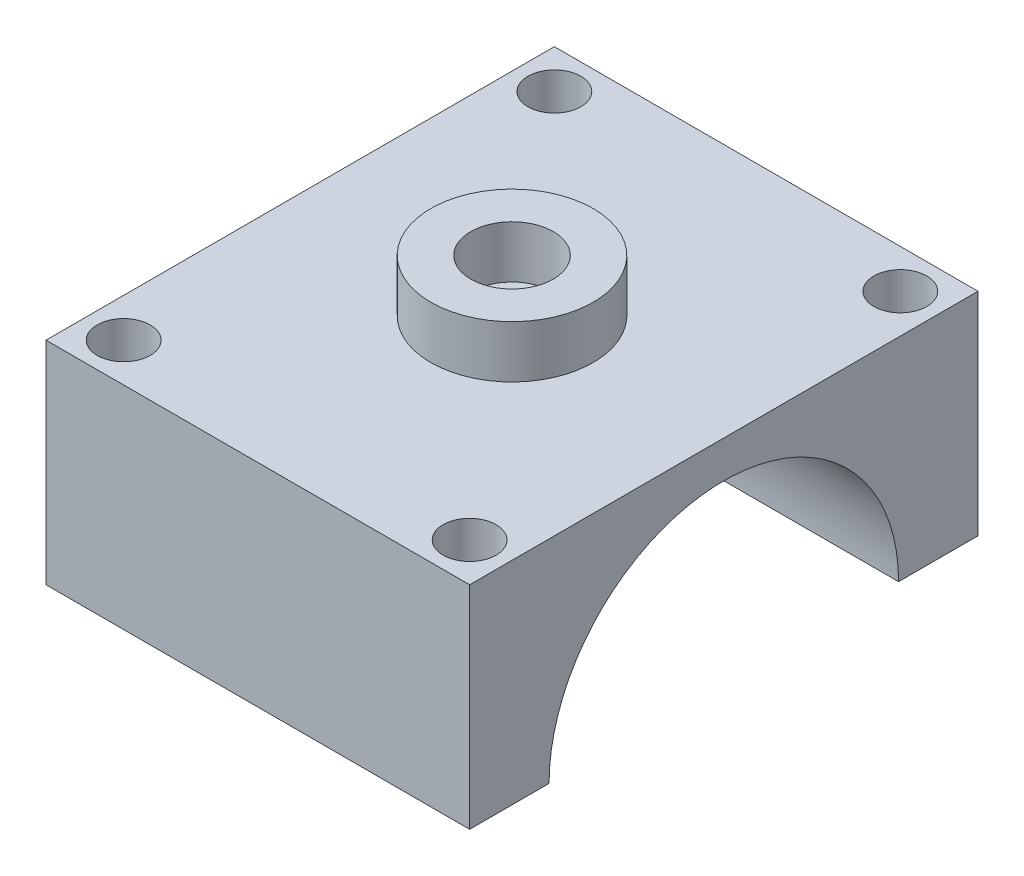
ISO-10303-21;
HEADER;
FILE_DESCRIPTION(('STEP AP214'),'2;1');
FILE_NAME('part.step','',(''),(''),'','','');
FILE_SCHEMA(('AUTOMOTIVE_DESIGN { 1 0 10303 214 1 1 1 1 }'));
ENDSEC;
DATA;
#1=APPLICATION_CONTEXT('core data for automotive mechanical design processes');
#2=APPLICATION_PROTOCOL_DEFINITION('international standard','automotive_design',2000,#1);
#3=PRODUCT_CONTEXT('',#1,'mechanical');
#4=PRODUCT('Part','Part','',(#3));
#5=PRODUCT_RELATED_PRODUCT_CATEGORY('part','',(#4));
#6=PRODUCT_DEFINITION_FORMATION('','',#4);
#7=PRODUCT_DEFINITION_CONTEXT('part definition',#1,'design');
#8=PRODUCT_DEFINITION('design','',#6,#7);
#9=PRODUCT_DEFINITION_SHAPE('','',#8);
#10=(LENGTH_UNIT() NAMED_UNIT(*) SI_UNIT(.MILLI.,.METRE.));
#11=(NAMED_UNIT(*) PLANE_ANGLE_UNIT() SI_UNIT($,.RADIAN.));
#12=(NAMED_UNIT(*) SI_UNIT($,.STERADIAN.) SOLID_ANGLE_UNIT());
#13=UNCERTAINTY_MEASURE_WITH_UNIT(LENGTH_MEASURE(1.E-05),#10,'distance_accuracy_value','');
#14=(GEOMETRIC_REPRESENTATION_CONTEXT(3) GLOBAL_UNCERTAINTY_ASSIGNED_CONTEXT((#13)) GLOBAL_UNIT_ASSIGNED_CONTEXT((#10,
#11,#12)) REPRESENTATION_CONTEXT('',''));
#15=CARTESIAN_POINT('',(0.,0.,0.));
#16=DIRECTION('',(0.,0.,1.));
#17=DIRECTION('',(1.,0.,0.));
#18=AXIS2_PLACEMENT_3D('',#15,#16,#17);
#19=CARTESIAN_POINT('',(0.,26.3,0.));
#20=DIRECTION('',(0.,1.,0.));
#21=DIRECTION('',(0.,0.,1.));
#22=AXIS2_PLACEMENT_3D('',#19,#20,#21);
#23=CYLINDRICAL_SURFACE('',#22,1.75);
#24=CARTESIAN_POINT('',(0.,30.,0.));
#25=DIRECTION('',(0.,1.,0.));
#26=DIRECTION('',(0.,0.,1.));
#27=AXIS2_PLACEMENT_3D('',#24,#25,#26);
#28=CIRCLE('',#27,1.75);
#29=CARTESIAN_POINT('',(0.,30.,1.75));
#30=VERTEX_POINT('',#29);
#31=EDGE_CURVE('E165',#30,#30,#28,.T.);
#32=ORIENTED_EDGE('',*,*,#31,.T.);
#33=EDGE_LOOP('',(#32));
#34=FACE_BOUND('',#33,.T.);
#35=CARTESIAN_POINT('',(0.,28.5,0.));
#36=DIRECTION('',(0.,-1.,0.));
#37=DIRECTION('',(0.,0.,-1.));
#38=AXIS2_PLACEMENT_3D('',#35,#36,#37);
#39=CIRCLE('',#38,1.75);
#40=CARTESIAN_POINT('',(0.,28.5,-1.75));
#41=VERTEX_POINT('',#40);
#42=EDGE_CURVE('E156',#41,#41,#39,.F.);
#43=ORIENTED_EDGE('',*,*,#42,.F.);
#44=EDGE_LOOP('',(#43));
#45=FACE_BOUND('',#44,.T.);
#46=ADVANCED_FACE('F49',(#34,#45),#23,.F.);
#47=CARTESIAN_POINT('',(15.,30.,18.));
#48=DIRECTION('',(-1.,0.,0.));
#49=DIRECTION('',(0.,0.,1.));
#50=AXIS2_PLACEMENT_3D('',#47,#48,#49);
#51=PLANE('',#50);
#52=DIRECTION('',(0.,-1.,0.));
#53=VECTOR('',#52,1.);
#54=CARTESIAN_POINT('',(15.,30.,18.));
#55=LINE('',#54,#53);
#56=CARTESIAN_POINT('',(15.,30.,18.));
#57=VERTEX_POINT('',#56);
#58=CARTESIAN_POINT('',(15.,15.,18.));
#59=VERTEX_POINT('',#58);
#60=EDGE_CURVE('E137',#57,#59,#55,.T.);
#61=ORIENTED_EDGE('',*,*,#60,.T.);
#62=DIRECTION('',(0.,0.,1.));
#63=VECTOR('',#62,1.);
#64=CARTESIAN_POINT('',(15.,15.,18.));
#65=LINE('',#64,#63);
#66=CARTESIAN_POINT('',(15.,15.,12.375));
#67=VERTEX_POINT('',#66);
#68=EDGE_CURVE('E111',#67,#59,#65,.T.);
#69=ORIENTED_EDGE('',*,*,#68,.F.);
#70=CARTESIAN_POINT('',(15.,15.,0.));
#71=DIRECTION('',(1.,0.,0.));
#72=DIRECTION('',(0.,0.,-1.));
#73=AXIS2_PLACEMENT_3D('',#70,#71,#72);
#74=CIRCLE('',#73,12.375);
#75=CARTESIAN_POINT('',(15.,15.,-12.375));
#76=VERTEX_POINT('',#75);
#77=EDGE_CURVE('E151',#76,#67,#74,.T.);
#78=ORIENTED_EDGE('',*,*,#77,.F.);
#79=CARTESIAN_POINT('',(15.,15.,-18.));
#80=VERTEX_POINT('',#79);
#81=EDGE_CURVE('E80',#80,#76,#65,.T.);
#82=ORIENTED_EDGE('',*,*,#81,.F.);
#83=DIRECTION('',(0.,-1.,0.));
#84=VECTOR('',#83,1.);
#85=CARTESIAN_POINT('',(15.,30.,-18.));
#86=LINE('',#85,#84);
#87=CARTESIAN_POINT('',(15.,30.,-18.));
#88=VERTEX_POINT('',#87);
#89=EDGE_CURVE('E64',#88,#80,#86,.T.);
#90=ORIENTED_EDGE('',*,*,#89,.F.);
#91=DIRECTION('',(0.,0.,-1.));
#92=VECTOR('',#91,1.);
#93=CARTESIAN_POINT('',(15.,30.,18.));
#94=LINE('',#93,#92);
#95=EDGE_CURVE('E150',#57,#88,#94,.T.);
#96=ORIENTED_EDGE('',*,*,#95,.F.);
#97=EDGE_LOOP('',(#61,#69,#78,#82,#90,#96));
#98=FACE_BOUND('',#97,.T.);
#99=ADVANCED_FACE('F51',(#98),#51,.F.);
#100=CARTESIAN_POINT('',(-15.,30.,-18.));
#101=DIRECTION('',(0.,0.,1.));
#102=DIRECTION('',(1.,0.,0.));
#103=AXIS2_PLACEMENT_3D('',#100,#101,#102);
#104=PLANE('',#103);
#105=ORIENTED_EDGE('',*,*,#89,.T.);
#106=DIRECTION('',(1.,0.,0.));
#107=VECTOR('',#106,1.);
#108=CARTESIAN_POINT('',(-15.,15.,-18.));
#109=LINE('',#108,#107);
#110=CARTESIAN_POINT('',(-15.,15.,-18.));
#111=VERTEX_POINT('',#110);
#112=EDGE_CURVE('E117',#111,#80,#109,.T.);
#113=ORIENTED_EDGE('',*,*,#112,.F.);
#114=DIRECTION('',(0.,-1.,0.));
#115=VECTOR('',#114,1.);
#116=CARTESIAN_POINT('',(-15.,30.,-18.));
#117=LINE('',#116,#115);
#118=CARTESIAN_POINT('',(-15.,30.,-18.));
#119=VERTEX_POINT('',#118);
#120=EDGE_CURVE('E136',#119,#111,#117,.T.);
#121=ORIENTED_EDGE('',*,*,#120,.F.);
#122=DIRECTION('',(-1.,0.,0.));
#123=VECTOR('',#122,1.);
#124=CARTESIAN_POINT('',(-15.,30.,-18.));
#125=LINE('',#124,#123);
#126=EDGE_CURVE('E230',#88,#119,#125,.T.);
#127=ORIENTED_EDGE('',*,*,#126,.F.);
#128=EDGE_LOOP('',(#105,#113,#121,#127));
#129=FACE_BOUND('',#128,.T.);
#130=ADVANCED_FACE('F244',(#129),#104,.F.);
#131=CARTESIAN_POINT('',(-15.,30.,18.));
#132=DIRECTION('',(1.,0.,0.));
#133=DIRECTION('',(0.,0.,-1.));
#134=AXIS2_PLACEMENT_3D('',#131,#132,#133);
#135=PLANE('',#134);
#136=ORIENTED_EDGE('',*,*,#120,.T.);
#137=DIRECTION('',(0.,0.,1.));
#138=VECTOR('',#137,1.);
#139=CARTESIAN_POINT('',(-15.,15.,18.));
#140=LINE('',#139,#138);
#141=CARTESIAN_POINT('',(-15.,15.,-12.375));
#142=VERTEX_POINT('',#141);
#143=EDGE_CURVE('E118',#111,#142,#140,.T.);
#144=ORIENTED_EDGE('',*,*,#143,.T.);
#145=CARTESIAN_POINT('',(-15.,15.,0.));
#146=DIRECTION('',(1.,0.,0.));
#147=DIRECTION('',(0.,0.,-1.));
#148=AXIS2_PLACEMENT_3D('',#145,#146,#147);
#149=CIRCLE('',#148,12.375);
#150=CARTESIAN_POINT('',(-15.,15.,12.375));
#151=VERTEX_POINT('',#150);
#152=EDGE_CURVE('E130',#142,#151,#149,.T.);
#153=ORIENTED_EDGE('',*,*,#152,.T.);
#154=CARTESIAN_POINT('',(-15.,15.,18.));
#155=VERTEX_POINT('',#154);
#156=EDGE_CURVE('E72',#151,#155,#140,.T.);
#157=ORIENTED_EDGE('',*,*,#156,.T.);
#158=DIRECTION('',(0.,-1.,0.));
#159=VECTOR('',#158,1.);
#160=CARTESIAN_POINT('',(-15.,30.,18.));
#161=LINE('',#160,#159);
#162=CARTESIAN_POINT('',(-15.,30.,18.));
#163=VERTEX_POINT('',#162);
#164=EDGE_CURVE('E126',#163,#155,#161,.T.);
#165=ORIENTED_EDGE('',*,*,#164,.F.);
#166=DIRECTION('',(0.,0.,1.));
#167=VECTOR('',#166,1.);
#168=CARTESIAN_POINT('',(-15.,30.,18.));
#169=LINE('',#168,#167);
#170=EDGE_CURVE('E233',#119,#163,#169,.T.);
#171=ORIENTED_EDGE('',*,*,#170,.F.);
#172=EDGE_LOOP('',(#136,#144,#153,#157,#165,#171));
#173=FACE_BOUND('',#172,.T.);
#174=ADVANCED_FACE('F124',(#173),#135,.F.);
#175=CARTESIAN_POINT('',(-15.,30.,18.));
#176=DIRECTION('',(0.,0.,-1.));
#177=DIRECTION('',(-1.,0.,0.));
#178=AXIS2_PLACEMENT_3D('',#175,#176,#177);
#179=PLANE('',#178);
#180=ORIENTED_EDGE('',*,*,#164,.T.);
#181=DIRECTION('',(1.,0.,0.));
#182=VECTOR('',#181,1.);
#183=CARTESIAN_POINT('',(-15.,15.,18.));
#184=LINE('',#183,#182);
#185=EDGE_CURVE('E108',#155,#59,#184,.T.);
#186=ORIENTED_EDGE('',*,*,#185,.T.);
#187=ORIENTED_EDGE('',*,*,#60,.F.);
#188=DIRECTION('',(1.,0.,0.));
#189=VECTOR('',#188,1.);
#190=CARTESIAN_POINT('',(-15.,30.,18.));
#191=LINE('',#190,#189);
#192=EDGE_CURVE('E134',#163,#57,#191,.T.);
#193=ORIENTED_EDGE('',*,*,#192,.F.);
#194=EDGE_LOOP('',(#180,#186,#187,#193));
#195=FACE_BOUND('',#194,.T.);
#196=ADVANCED_FACE('F133',(#195),#179,.F.);
#197=CARTESIAN_POINT('',(0.,30.,0.));
#198=DIRECTION('',(0.,-1.,0.));
#199=DIRECTION('',(0.,0.,-1.));
#200=AXIS2_PLACEMENT_3D('',#197,#198,#199);
#201=PLANE('',#200);
#202=CARTESIAN_POINT('',(0.,30.,0.));
#203=DIRECTION('',(0.,-1.,0.));
#204=DIRECTION('',(0.,0.,-1.));
#205=AXIS2_PLACEMENT_3D('',#202,#203,#204);
#206=CIRCLE('',#205,5.75);
#207=CARTESIAN_POINT('',(0.,30.,-5.75));
#208=VERTEX_POINT('',#207);
#209=EDGE_CURVE('E11',#208,#208,#206,.F.);
#210=ORIENTED_EDGE('',*,*,#209,.F.);
#211=EDGE_LOOP('',(#210));
#212=FACE_BOUND('',#211,.T.);
#213=CARTESIAN_POINT('',(12.25,30.,-15.25));
#214=DIRECTION('',(0.,1.,0.));
#215=DIRECTION('',(0.,0.,-1.));
#216=AXIS2_PLACEMENT_3D('',#213,#214,#215);
#217=CIRCLE('',#216,1.875);
#218=CARTESIAN_POINT('',(12.25,30.,-17.125));
#219=VERTEX_POINT('',#218);
#220=EDGE_CURVE('E208',#219,#219,#217,.T.);
#221=ORIENTED_EDGE('',*,*,#220,.F.);
#222=EDGE_LOOP('',(#221));
#223=FACE_BOUND('',#222,.T.);
#224=CARTESIAN_POINT('',(12.25,30.,15.25));
#225=DIRECTION('',(0.,1.,0.));
#226=DIRECTION('',(0.,0.,1.));
#227=AXIS2_PLACEMENT_3D('',#224,#225,#226);
#228=CIRCLE('',#227,1.875);
#229=CARTESIAN_POINT('',(12.25,30.,17.125));
#230=VERTEX_POINT('',#229);
#231=EDGE_CURVE('E214',#230,#230,#228,.T.);
#232=ORIENTED_EDGE('',*,*,#231,.F.);
#233=EDGE_LOOP('',(#232));
#234=FACE_BOUND('',#233,.T.);
#235=CARTESIAN_POINT('',(-12.25,30.,15.25));
#236=DIRECTION('',(0.,1.,0.));
#237=DIRECTION('',(0.,0.,-1.));
#238=AXIS2_PLACEMENT_3D('',#235,#236,#237);
#239=CIRCLE('',#238,1.875);
#240=CARTESIAN_POINT('',(-12.25,30.,13.375));
#241=VERTEX_POINT('',#240);
#242=EDGE_CURVE('E209',#241,#241,#239,.T.);
#243=ORIENTED_EDGE('',*,*,#242,.F.);
#244=EDGE_LOOP('',(#243));
#245=FACE_BOUND('',#244,.T.);
#246=CARTESIAN_POINT('',(-12.25,30.,-15.25));
#247=DIRECTION('',(0.,1.,0.));
#248=DIRECTION('',(0.,0.,1.));
#249=AXIS2_PLACEMENT_3D('',#246,#247,#248);
#250=CIRCLE('',#249,1.875);
#251=CARTESIAN_POINT('',(-12.25,30.,-13.375));
#252=VERTEX_POINT('',#251);
#253=EDGE_CURVE('E213',#252,#252,#250,.T.);
#254=ORIENTED_EDGE('',*,*,#253,.F.);
#255=EDGE_LOOP('',(#254));
#256=FACE_BOUND('',#255,.T.);
#257=ORIENTED_EDGE('',*,*,#95,.T.);
#258=ORIENTED_EDGE('',*,*,#126,.T.);
#259=ORIENTED_EDGE('',*,*,#170,.T.);
#260=ORIENTED_EDGE('',*,*,#192,.T.);
#261=EDGE_LOOP('',(#257,#258,#259,#260));
#262=FACE_BOUND('',#261,.T.);
#263=ADVANCED_FACE('F237',(#212,#223,#234,#245,#256,#262),#201,.F.);
#264=CARTESIAN_POINT('',(-25.,15.,0.));
#265=DIRECTION('',(1.,0.,0.));
#266=DIRECTION('',(0.,0.,-1.));
#267=AXIS2_PLACEMENT_3D('',#264,#265,#266);
#268=CYLINDRICAL_SURFACE('',#267,12.375);
#269=CARTESIAN_POINT('',(0.,27.1094229837759,-2.55));
#270=CARTESIAN_POINT('',(-0.141593486579068,27.1094258233246,-2.54999487368617));
#271=CARTESIAN_POINT('',(-0.28325058965711,27.1119334442797,-2.53816656528584));
#272=CARTESIAN_POINT('',(-0.562550791617207,27.1216770977762,-2.49120914771969));
#273=CARTESIAN_POINT('',(-0.700190689760676,27.1289167986897,-2.45606196112719));
#274=CARTESIAN_POINT('',(-0.967375513825336,27.1472706500951,-2.36360846161499));
#275=CARTESIAN_POINT('',(-1.09692859333259,27.1583808212482,-2.30632490113769));
#276=CARTESIAN_POINT('',(-1.34458389748289,27.1832190285556,-2.17128794017694));
#277=CARTESIAN_POINT('',(-1.46268663319514,27.1969469477893,-2.09353545386981));
#278=CARTESIAN_POINT('',(-1.68586559560199,27.2257039814417,-1.91852416926363));
#279=CARTESIAN_POINT('',(-1.79074500205086,27.2407481278147,-1.82101680953067));
#280=CARTESIAN_POINT('',(-1.98278016595367,27.2703104417129,-1.60980055761418));
#281=CARTESIAN_POINT('',(-2.06993463959471,27.2848285710763,-1.49609049288606));
#282=CARTESIAN_POINT('',(-2.22481437218095,27.3118656828606,-1.25438812140887));
#283=CARTESIAN_POINT('',(-2.29235187491802,27.3243648685796,-1.12627309835017));
#284=CARTESIAN_POINT('',(-2.40486797444841,27.345786617002,-0.860212664955008));
#285=CARTESIAN_POINT('',(-2.44984881412003,27.354709535287,-0.722268233545229));
#286=CARTESIAN_POINT('',(-2.51536004415097,27.367867171375,-0.442508602124721));
#287=CARTESIAN_POINT('',(-2.53622303816856,27.3721656054528,-0.300774334633615));
#288=CARTESIAN_POINT('',(-2.55394475478111,27.3758102342305,-0.0157566124680954));
#289=CARTESIAN_POINT('',(-2.55080592668282,27.3751569342386,0.127526682643073));
#290=CARTESIAN_POINT('',(-2.5208639368815,27.3690208636067,0.409287363376315));
#291=CARTESIAN_POINT('',(-2.49441911499341,27.3636112266707,0.547804654083666));
#292=CARTESIAN_POINT('',(-2.41918501782782,27.3486530479192,0.818392413020192));
#293=CARTESIAN_POINT('',(-2.37039481038242,27.3391043334373,0.950462612045874));
#294=CARTESIAN_POINT('',(-2.2515276903385,27.3168212759106,1.20542080038144));
#295=CARTESIAN_POINT('',(-2.18131182708416,27.3040662371466,1.32824212506679));
#296=CARTESIAN_POINT('',(-2.02168962628024,27.2767742941617,1.56049095091511));
#297=CARTESIAN_POINT('',(-1.93228095181449,27.262237173047,1.66991681849757));
#298=CARTESIAN_POINT('',(-1.73484991993273,27.2326673264138,1.8743966352326));
#299=CARTESIAN_POINT('',(-1.6265139346108,27.2176304071991,1.96914740344973));
#300=CARTESIAN_POINT('',(-1.39533683692867,27.1890097158696,2.13918777208633));
#301=CARTESIAN_POINT('',(-1.2724954154664,27.1754259747329,2.21447695768216));
#302=CARTESIAN_POINT('',(-1.01534191347891,27.1512404567945,2.34357092006132));
#303=CARTESIAN_POINT('',(-0.881003183425899,27.1406458666574,2.3973240468194));
#304=CARTESIAN_POINT('',(-0.604931281766242,27.1237416442318,2.48140516958627));
#305=CARTESIAN_POINT('',(-0.463199141756312,27.1174314158625,2.51173642434707));
#306=CARTESIAN_POINT('',(-0.179118587675568,27.109930496443,2.54765432407468));
#307=CARTESIAN_POINT('',(-0.0368280088922405,27.1086489983491,2.55367992836934));
#308=CARTESIAN_POINT('',(0.246724881855127,27.1111065075448,2.5419989570186));
#309=CARTESIAN_POINT('',(0.387987255442668,27.1148452114254,2.52429381560306));
#310=CARTESIAN_POINT('',(0.663981787896315,27.1268366040265,2.46603314390939));
#311=CARTESIAN_POINT('',(0.798766154080588,27.1350424874344,2.42571441928581));
#312=CARTESIAN_POINT('',(1.05966661820408,27.1550022303182,2.3236252855221));
#313=CARTESIAN_POINT('',(1.18578196384889,27.1667563972369,2.26185301745959));
#314=CARTESIAN_POINT('',(1.42767856446818,27.1926909006818,2.1176250103071));
#315=CARTESIAN_POINT('',(1.543293438318,27.2069024423378,2.0348959422588));
#316=CARTESIAN_POINT('',(1.75916006396065,27.23606585402,1.85146493472999));
#317=CARTESIAN_POINT('',(1.85941013017025,27.2510178050345,1.75076102595419));
#318=CARTESIAN_POINT('',(2.04337810674671,27.2802735020869,1.5322633776663));
#319=CARTESIAN_POINT('',(2.12679843531568,27.2945626253106,1.41421680429038));
#320=CARTESIAN_POINT('',(2.27262278296196,27.3206238875555,1.16552987793585));
#321=CARTESIAN_POINT('',(2.33502771837091,27.3323961363116,1.03489007437792));
#322=CARTESIAN_POINT('',(2.43662212349371,27.3520350357901,0.765487264765787));
#323=CARTESIAN_POINT('',(2.47594843767552,27.3599246624963,0.626777613948778));
#324=CARTESIAN_POINT('',(2.53070103599283,27.3710081738698,0.344541617473981));
#325=CARTESIAN_POINT('',(2.54613038476026,27.3742026606558,0.201015891859106));
#326=CARTESIAN_POINT('',(2.55252634627778,27.3755205767727,-0.0839412554824206));
#327=CARTESIAN_POINT('',(2.5439393634246,27.3737365458541,-0.225362417812729));
#328=CARTESIAN_POINT('',(2.50353611073098,27.3654936091618,-0.504700139655926));
#329=CARTESIAN_POINT('',(2.47172017065992,27.3590347697541,-0.642616748892363));
#330=CARTESIAN_POINT('',(2.38596556160053,27.3421718929597,-0.910731067217611));
#331=CARTESIAN_POINT('',(2.33208359572822,27.3317779726919,-1.04094758891246));
#332=CARTESIAN_POINT('',(2.20378447112837,27.3081611329174,-1.2905542620107));
#333=CARTESIAN_POINT('',(2.12936556943137,27.2949379733147,-1.40994349335895));
#334=CARTESIAN_POINT('',(1.96061497098723,27.2668298671646,-1.63670464481538));
#335=CARTESIAN_POINT('',(1.86596558454986,27.2519204443769,-1.74383713865343));
#336=CARTESIAN_POINT('',(1.66008984775821,27.2222611951161,-1.94085186982933));
#337=CARTESIAN_POINT('',(1.54885955816061,27.2075114074643,-2.03072999628366));
#338=CARTESIAN_POINT('',(1.31143420316018,27.1796528178664,-2.19167718198478));
#339=CARTESIAN_POINT('',(1.18508089746403,27.166564974631,-2.26251660958543));
#340=CARTESIAN_POINT('',(0.922026931739482,27.1437703438008,-2.38184520329796));
#341=CARTESIAN_POINT('',(0.785335588605331,27.1340605549992,-2.43035422114207));
#342=CARTESIAN_POINT('',(0.540321876726547,27.1210150657628,-2.49447126150003));
#343=CARTESIAN_POINT('',(0.43337652448973,27.1166955668939,-2.51525645438924));
#344=CARTESIAN_POINT('',(0.217633262322054,27.1108984894409,-2.54302252739419));
#345=CARTESIAN_POINT('',(0.108835424059383,27.109420801165,-2.5500039403263));
#346=CARTESIAN_POINT('',(0.,27.1094229837759,-2.55));
#347=B_SPLINE_CURVE_WITH_KNOTS('',3,(#269,#270,#271,#272,#273,#274,#275,#276,#277,#278,#279,
#280,#281,#282,#283,#284,#285,#286,#287,#288,#289,#290,#291,#292,#293,#294,#295,#296,#297,#298,
#299,#300,#301,#302,#303,#304,#305,#306,#307,#308,#309,#310,#311,#312,#313,#314,#315,#316,#317,
#318,#319,#320,#321,#322,#323,#324,#325,#326,#327,#328,#329,#330,#331,#332,#333,#334,#335,#336,
#337,#338,#339,#340,#341,#342,#343,#344,#345,#346),.UNSPECIFIED.,.T.,.F.,(4,2,2,2,2,2,2,2,2,2,2,
2,2,2,2,2,2,2,2,2,2,2,2,2,2,2,2,2,2,2,2,2,2,2,2,2,2,2,4),(0.,0.424381847414037,
0.849093072157422,1.27336892182702,1.69762582584393,2.1275954941126,2.55759629390532,
2.99158642833251,3.4255334012268,3.85342170124938,4.28126633726565,4.70264524858506,
5.12404173989552,5.54823136447645,5.97247266770024,6.40455896739082,6.8366544762414,
7.26978016590334,7.70284558268653,8.12805385763186,8.55323643515853,8.97404753859467,
9.39489511388112,9.82154286816228,10.2482373940237,10.6819187548537,11.1155812034786,
11.5466455715729,11.9776546538591,12.4007058622236,12.8237510648677,13.2457159214263,
13.6677166011561,14.096907785211,14.5262010982632,14.9604609077277,15.3943339111446,
15.7205463829349,16.0467462629034),.UNSPECIFIED.);
#348=CARTESIAN_POINT('',(0.,27.1094229837759,-2.55));
#349=VERTEX_POINT('',#348);
#350=EDGE_CURVE('E53',#349,#349,#347,.T.);
#351=ORIENTED_EDGE('',*,*,#350,.T.);
#352=EDGE_LOOP('',(#351));
#353=FACE_BOUND('',#352,.T.);
#354=ORIENTED_EDGE('',*,*,#77,.T.);
#355=DIRECTION('',(1.,0.,0.));
#356=VECTOR('',#355,1.);
#357=CARTESIAN_POINT('',(-25.,15.,12.375));
#358=LINE('',#357,#356);
#359=EDGE_CURVE('E205',#67,#151,#358,.F.);
#360=ORIENTED_EDGE('',*,*,#359,.T.);
#361=ORIENTED_EDGE('',*,*,#152,.F.);
#362=DIRECTION('',(1.,0.,0.));
#363=VECTOR('',#362,1.);
#364=CARTESIAN_POINT('',(-25.,15.,-12.375));
#365=LINE('',#364,#363);
#366=EDGE_CURVE('E202',#142,#76,#365,.T.);
#367=ORIENTED_EDGE('',*,*,#366,.T.);
#368=EDGE_LOOP('',(#354,#360,#361,#367));
#369=FACE_BOUND('',#368,.T.);
#370=ADVANCED_FACE('F247',(#353,#369),#268,.F.);
#371=CARTESIAN_POINT('',(-12.25,-10.,-15.25));
#372=DIRECTION('',(0.,1.,0.));
#373=DIRECTION('',(0.,0.,1.));
#374=AXIS2_PLACEMENT_3D('',#371,#372,#373);
#375=CYLINDRICAL_SURFACE('',#374,1.875);
#376=CARTESIAN_POINT('',(-12.25,15.,-15.25));
#377=DIRECTION('',(0.,1.,0.));
#378=DIRECTION('',(0.,0.,1.));
#379=AXIS2_PLACEMENT_3D('',#376,#377,#378);
#380=CIRCLE('',#379,1.875);
#381=CARTESIAN_POINT('',(-12.25,15.,-13.375));
#382=VERTEX_POINT('',#381);
#383=EDGE_CURVE('E198',#382,#382,#380,.F.);
#384=ORIENTED_EDGE('',*,*,#383,.T.);
#385=EDGE_LOOP('',(#384));
#386=FACE_BOUND('',#385,.T.);
#387=ORIENTED_EDGE('',*,*,#253,.T.);
#388=EDGE_LOOP('',(#387));
#389=FACE_BOUND('',#388,.T.);
#390=ADVANCED_FACE('F309',(#386,#389),#375,.F.);
#391=CARTESIAN_POINT('',(-12.25,-10.,15.25));
#392=DIRECTION('',(0.,1.,0.));
#393=DIRECTION('',(0.,0.,1.));
#394=AXIS2_PLACEMENT_3D('',#391,#392,#393);
#395=CYLINDRICAL_SURFACE('',#394,1.875);
#396=CARTESIAN_POINT('',(-12.25,15.,15.25));
#397=DIRECTION('',(0.,1.,0.));
#398=DIRECTION('',(0.,0.,1.));
#399=AXIS2_PLACEMENT_3D('',#396,#397,#398);
#400=CIRCLE('',#399,1.875);
#401=CARTESIAN_POINT('',(-12.25,15.,17.125));
#402=VERTEX_POINT('',#401);
#403=EDGE_CURVE('E194',#402,#402,#400,.F.);
#404=ORIENTED_EDGE('',*,*,#403,.T.);
#405=EDGE_LOOP('',(#404));
#406=FACE_BOUND('',#405,.T.);
#407=ORIENTED_EDGE('',*,*,#242,.T.);
#408=EDGE_LOOP('',(#407));
#409=FACE_BOUND('',#408,.T.);
#410=ADVANCED_FACE('F311',(#406,#409),#395,.F.);
#411=CARTESIAN_POINT('',(12.25,-10.,15.25));
#412=DIRECTION('',(0.,1.,0.));
#413=DIRECTION('',(0.,0.,1.));
#414=AXIS2_PLACEMENT_3D('',#411,#412,#413);
#415=CYLINDRICAL_SURFACE('',#414,1.875);
#416=CARTESIAN_POINT('',(12.25,15.,15.25));
#417=DIRECTION('',(0.,1.,0.));
#418=DIRECTION('',(0.,0.,1.));
#419=AXIS2_PLACEMENT_3D('',#416,#417,#418);
#420=CIRCLE('',#419,1.875);
#421=CARTESIAN_POINT('',(12.25,15.,17.125));
#422=VERTEX_POINT('',#421);
#423=EDGE_CURVE('E155',#422,#422,#420,.F.);
#424=ORIENTED_EDGE('',*,*,#423,.T.);
#425=EDGE_LOOP('',(#424));
#426=FACE_BOUND('',#425,.T.);
#427=ORIENTED_EDGE('',*,*,#231,.T.);
#428=EDGE_LOOP('',(#427));
#429=FACE_BOUND('',#428,.T.);
#430=ADVANCED_FACE('F260',(#426,#429),#415,.F.);
#431=CARTESIAN_POINT('',(12.25,-10.,-15.25));
#432=DIRECTION('',(0.,1.,0.));
#433=DIRECTION('',(0.,0.,1.));
#434=AXIS2_PLACEMENT_3D('',#431,#432,#433);
#435=CYLINDRICAL_SURFACE('',#434,1.875);
#436=CARTESIAN_POINT('',(12.25,15.,-15.25));
#437=DIRECTION('',(0.,1.,0.));
#438=DIRECTION('',(0.,0.,1.));
#439=AXIS2_PLACEMENT_3D('',#436,#437,#438);
#440=CIRCLE('',#439,1.875);
#441=CARTESIAN_POINT('',(12.25,15.,-13.375));
#442=VERTEX_POINT('',#441);
#443=EDGE_CURVE('E152',#442,#442,#440,.F.);
#444=ORIENTED_EDGE('',*,*,#443,.T.);
#445=EDGE_LOOP('',(#444));
#446=FACE_BOUND('',#445,.T.);
#447=ORIENTED_EDGE('',*,*,#220,.T.);
#448=EDGE_LOOP('',(#447));
#449=FACE_BOUND('',#448,.T.);
#450=ADVANCED_FACE('F251',(#446,#449),#435,.F.);
#451=CARTESIAN_POINT('',(-15.,15.,18.));
#452=DIRECTION('',(0.,1.,0.));
#453=DIRECTION('',(0.,0.,1.));
#454=AXIS2_PLACEMENT_3D('',#451,#452,#453);
#455=PLANE('',#454);
#456=ORIENTED_EDGE('',*,*,#383,.F.);
#457=EDGE_LOOP('',(#456));
#458=FACE_BOUND('',#457,.T.);
#459=ORIENTED_EDGE('',*,*,#443,.F.);
#460=EDGE_LOOP('',(#459));
#461=FACE_BOUND('',#460,.T.);
#462=ORIENTED_EDGE('',*,*,#143,.F.);
#463=ORIENTED_EDGE('',*,*,#112,.T.);
#464=ORIENTED_EDGE('',*,*,#81,.T.);
#465=ORIENTED_EDGE('',*,*,#366,.F.);
#466=EDGE_LOOP('',(#462,#463,#464,#465));
#467=FACE_BOUND('',#466,.T.);
#468=ADVANCED_FACE('F249',(#458,#461,#467),#455,.F.);
#469=ORIENTED_EDGE('',*,*,#403,.F.);
#470=EDGE_LOOP('',(#469));
#471=FACE_BOUND('',#470,.T.);
#472=ORIENTED_EDGE('',*,*,#423,.F.);
#473=EDGE_LOOP('',(#472));
#474=FACE_BOUND('',#473,.T.);
#475=ORIENTED_EDGE('',*,*,#68,.T.);
#476=ORIENTED_EDGE('',*,*,#185,.F.);
#477=ORIENTED_EDGE('',*,*,#156,.F.);
#478=ORIENTED_EDGE('',*,*,#359,.F.);
#479=EDGE_LOOP('',(#475,#476,#477,#478));
#480=FACE_BOUND('',#479,.T.);
#481=ADVANCED_FACE('F109',(#471,#474,#480),#455,.F.);
#482=CARTESIAN_POINT('',(0.,33.7,0.));
#483=DIRECTION('',(0.,-1.,0.));
#484=DIRECTION('',(0.,0.,-1.));
#485=AXIS2_PLACEMENT_3D('',#482,#483,#484);
#486=CYLINDRICAL_SURFACE('',#485,5.75);
#487=CARTESIAN_POINT('',(0.,33.7,0.));
#488=DIRECTION('',(0.,1.,0.));
#489=DIRECTION('',(0.,0.,1.));
#490=AXIS2_PLACEMENT_3D('',#487,#488,#489);
#491=CIRCLE('',#490,5.75);
#492=CARTESIAN_POINT('',(0.,33.7,5.75));
#493=VERTEX_POINT('',#492);
#494=EDGE_CURVE('E179',#493,#493,#491,.T.);
#495=ORIENTED_EDGE('',*,*,#494,.F.);
#496=EDGE_LOOP('',(#495));
#497=FACE_BOUND('',#496,.T.);
#498=ORIENTED_EDGE('',*,*,#209,.T.);
#499=EDGE_LOOP('',(#498));
#500=FACE_BOUND('',#499,.T.);
#501=ADVANCED_FACE('F258',(#497,#500),#486,.T.);
#502=CARTESIAN_POINT('',(0.,33.7,0.));
#503=DIRECTION('',(0.,1.,0.));
#504=DIRECTION('',(0.,0.,1.));
#505=AXIS2_PLACEMENT_3D('',#502,#503,#504);
#506=PLANE('',#505);
#507=CARTESIAN_POINT('',(0.,33.7,0.));
#508=DIRECTION('',(0.,1.,0.));
#509=DIRECTION('',(0.,0.,1.));
#510=AXIS2_PLACEMENT_3D('',#507,#508,#509);
#511=CIRCLE('',#510,2.92);
#512=CARTESIAN_POINT('',(0.,33.7,2.92));
#513=VERTEX_POINT('',#512);
#514=EDGE_CURVE('E174',#513,#513,#511,.T.);
#515=ORIENTED_EDGE('',*,*,#514,.F.);
#516=EDGE_LOOP('',(#515));
#517=FACE_BOUND('',#516,.T.);
#518=ORIENTED_EDGE('',*,*,#494,.T.);
#519=EDGE_LOOP('',(#518));
#520=FACE_BOUND('',#519,.T.);
#521=ADVANCED_FACE('F286',(#517,#520),#506,.T.);
#522=CARTESIAN_POINT('',(0.,30.,0.));
#523=DIRECTION('',(0.,1.,0.));
#524=DIRECTION('',(0.,0.,1.));
#525=AXIS2_PLACEMENT_3D('',#522,#523,#524);
#526=CYLINDRICAL_SURFACE('',#525,2.92);
#527=CARTESIAN_POINT('',(0.,30.,0.));
#528=DIRECTION('',(0.,1.,0.));
#529=DIRECTION('',(0.,0.,1.));
#530=AXIS2_PLACEMENT_3D('',#527,#528,#529);
#531=CIRCLE('',#530,2.92);
#532=CARTESIAN_POINT('',(0.,30.,2.92));
#533=VERTEX_POINT('',#532);
#534=EDGE_CURVE('E175',#533,#533,#531,.T.);
#535=ORIENTED_EDGE('',*,*,#534,.F.);
#536=EDGE_LOOP('',(#535));
#537=FACE_BOUND('',#536,.T.);
#538=ORIENTED_EDGE('',*,*,#514,.T.);
#539=EDGE_LOOP('',(#538));
#540=FACE_BOUND('',#539,.T.);
#541=ADVANCED_FACE('F282',(#537,#540),#526,.F.);
#542=CARTESIAN_POINT('',(0.,30.,0.));
#543=DIRECTION('',(0.,1.,0.));
#544=DIRECTION('',(0.,0.,1.));
#545=AXIS2_PLACEMENT_3D('',#542,#543,#544);
#546=PLANE('',#545);
#547=ORIENTED_EDGE('',*,*,#31,.F.);
#548=EDGE_LOOP('',(#547));
#549=FACE_BOUND('',#548,.T.);
#550=ORIENTED_EDGE('',*,*,#534,.T.);
#551=EDGE_LOOP('',(#550));
#552=FACE_BOUND('',#551,.T.);
#553=ADVANCED_FACE('F280',(#549,#552),#546,.T.);
#554=CARTESIAN_POINT('',(0.,28.5,0.));
#555=DIRECTION('',(0.,-1.,0.));
#556=DIRECTION('',(0.,0.,-1.));
#557=AXIS2_PLACEMENT_3D('',#554,#555,#556);
#558=CYLINDRICAL_SURFACE('',#557,2.55);
#559=CARTESIAN_POINT('',(0.,28.5,0.));
#560=DIRECTION('',(0.,-1.,0.));
#561=DIRECTION('',(0.,0.,-1.));
#562=AXIS2_PLACEMENT_3D('',#559,#560,#561);
#563=CIRCLE('',#562,2.55);
#564=CARTESIAN_POINT('',(0.,28.5,-2.55));
#565=VERTEX_POINT('',#564);
#566=EDGE_CURVE('E159',#565,#565,#563,.T.);
#567=ORIENTED_EDGE('',*,*,#566,.F.);
#568=EDGE_LOOP('',(#567));
#569=FACE_BOUND('',#568,.T.);
#570=ORIENTED_EDGE('',*,*,#350,.F.);
#571=EDGE_LOOP('',(#570));
#572=FACE_BOUND('',#571,.T.);
#573=ADVANCED_FACE('F277',(#569,#572),#558,.F.);
#574=CARTESIAN_POINT('',(0.,28.5,0.));
#575=DIRECTION('',(0.,-1.,0.));
#576=DIRECTION('',(0.,0.,-1.));
#577=AXIS2_PLACEMENT_3D('',#574,#575,#576);
#578=PLANE('',#577);
#579=ORIENTED_EDGE('',*,*,#566,.T.);
#580=EDGE_LOOP('',(#579));
#581=FACE_BOUND('',#580,.T.);
#582=ORIENTED_EDGE('',*,*,#42,.T.);
#583=EDGE_LOOP('',(#582));
#584=FACE_BOUND('',#583,.T.);
#585=ADVANCED_FACE('F380',(#581,#584),#578,.T.);
#586=CLOSED_SHELL('',(#46,#99,#130,#174,#196,#263,#370,#390,#410,#430,#450,#468,#481,#501,#521,
#541,#553,#573,#585));
#587=MANIFOLD_SOLID_BREP('B2',#586);
#588=ADVANCED_BREP_SHAPE_REPRESENTATION('',(#18,#587),#14);
#589=SHAPE_DEFINITION_REPRESENTATION(#9,#588);
ENDSEC;
END-ISO-10303-21;
